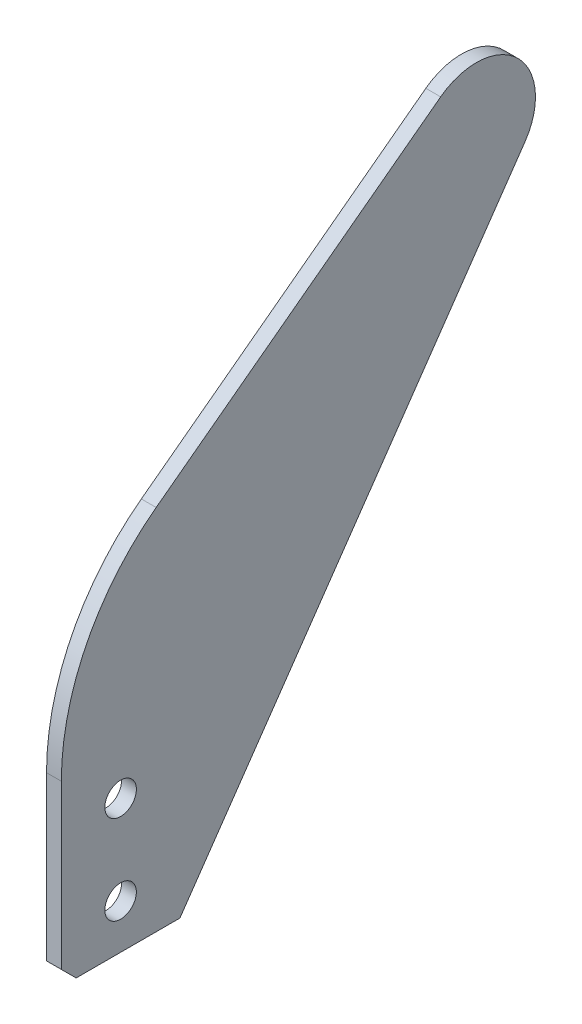
ISO-10303-21;
HEADER;
FILE_DESCRIPTION(('STEP AP214'),'2;1');
FILE_NAME('part.step','',(''),(''),'','','');
FILE_SCHEMA(('AUTOMOTIVE_DESIGN { 1 0 10303 214 1 1 1 1 }'));
ENDSEC;
DATA;
#1=APPLICATION_CONTEXT('core data for automotive mechanical design processes');
#2=APPLICATION_PROTOCOL_DEFINITION('international standard','automotive_design',2000,#1);
#3=PRODUCT_CONTEXT('',#1,'mechanical');
#4=PRODUCT('Part','Part','',(#3));
#5=PRODUCT_RELATED_PRODUCT_CATEGORY('part','',(#4));
#6=PRODUCT_DEFINITION_FORMATION('','',#4);
#7=PRODUCT_DEFINITION_CONTEXT('part definition',#1,'design');
#8=PRODUCT_DEFINITION('design','',#6,#7);
#9=PRODUCT_DEFINITION_SHAPE('','',#8);
#10=(LENGTH_UNIT() NAMED_UNIT(*) SI_UNIT(.MILLI.,.METRE.));
#11=(NAMED_UNIT(*) PLANE_ANGLE_UNIT() SI_UNIT($,.RADIAN.));
#12=(NAMED_UNIT(*) SI_UNIT($,.STERADIAN.) SOLID_ANGLE_UNIT());
#13=UNCERTAINTY_MEASURE_WITH_UNIT(LENGTH_MEASURE(1.E-05),#10,'distance_accuracy_value','');
#14=(GEOMETRIC_REPRESENTATION_CONTEXT(3) GLOBAL_UNCERTAINTY_ASSIGNED_CONTEXT((#13)) GLOBAL_UNIT_ASSIGNED_CONTEXT((#10,
#11,#12)) REPRESENTATION_CONTEXT('',''));
#15=CARTESIAN_POINT('',(0.,0.,0.));
#16=DIRECTION('',(0.,0.,1.));
#17=DIRECTION('',(1.,0.,0.));
#18=AXIS2_PLACEMENT_3D('',#15,#16,#17);
#19=CARTESIAN_POINT('',(3.175,114.3,-88.9));
#20=DIRECTION('',(-1.,0.,0.));
#21=DIRECTION('',(0.,0.,1.));
#22=AXIS2_PLACEMENT_3D('',#19,#20,#21);
#23=PLANE('',#22);
#24=DIRECTION('',(0.,-1.,0.));
#25=VECTOR('',#24,1.);
#26=CARTESIAN_POINT('',(3.175,0.,0.));
#27=LINE('',#26,#25);
#28=CARTESIAN_POINT('',(3.175,38.1,0.));
#29=VERTEX_POINT('',#28);
#30=CARTESIAN_POINT('',(3.175,3.17500000000001,0.));
#31=VERTEX_POINT('',#30);
#32=EDGE_CURVE('E140',#29,#31,#27,.T.);
#33=ORIENTED_EDGE('',*,*,#32,.T.);
#34=DIRECTION('',(0.,0.707106781186548,0.707106781186548));
#35=VECTOR('',#34,1.);
#36=CARTESIAN_POINT('',(3.175,0.,-3.17500000000001));
#37=LINE('',#36,#35);
#38=CARTESIAN_POINT('',(3.175,0.,-3.17500000000001));
#39=VERTEX_POINT('',#38);
#40=EDGE_CURVE('E11',#31,#39,#37,.F.);
#41=ORIENTED_EDGE('',*,*,#40,.T.);
#42=DIRECTION('',(0.,0.,-1.));
#43=VECTOR('',#42,1.);
#44=CARTESIAN_POINT('',(3.175,0.,0.));
#45=LINE('',#44,#43);
#46=CARTESIAN_POINT('',(3.175,0.,-25.4));
#47=VERTEX_POINT('',#46);
#48=EDGE_CURVE('E101',#39,#47,#45,.T.);
#49=ORIENTED_EDGE('',*,*,#48,.T.);
#50=DIRECTION('',(0.,0.822854310317324,-0.568252394620736));
#51=VECTOR('',#50,1.);
#52=CARTESIAN_POINT('',(3.175,0.,-25.4));
#53=LINE('',#52,#51);
#54=CARTESIAN_POINT('',(3.175,107.083194588317,-99.35024974103));
#55=VERTEX_POINT('',#54);
#56=EDGE_CURVE('E104',#47,#55,#53,.T.);
#57=ORIENTED_EDGE('',*,*,#56,.T.);
#58=CARTESIAN_POINT('',(3.175,114.3,-88.9));
#59=DIRECTION('',(1.,0.,0.));
#60=DIRECTION('',(0.,0.,1.));
#61=AXIS2_PLACEMENT_3D('',#58,#59,#60);
#62=CIRCLE('',#61,12.7);
#63=CARTESIAN_POINT('',(3.175,124.46,-81.28));
#64=VERTEX_POINT('',#63);
#65=EDGE_CURVE('E120',#55,#64,#62,.T.);
#66=ORIENTED_EDGE('',*,*,#65,.T.);
#67=DIRECTION('',(0.,-0.6,0.8));
#68=VECTOR('',#67,1.);
#69=CARTESIAN_POINT('',(3.175,124.46,-81.28));
#70=LINE('',#69,#68);
#71=CARTESIAN_POINT('',(3.175,78.74,-20.32));
#72=VERTEX_POINT('',#71);
#73=EDGE_CURVE('E155',#64,#72,#70,.T.);
#74=ORIENTED_EDGE('',*,*,#73,.T.);
#75=CARTESIAN_POINT('',(3.175,38.1,-50.8));
#76=DIRECTION('',(1.,0.,0.));
#77=DIRECTION('',(0.,0.,-1.));
#78=AXIS2_PLACEMENT_3D('',#75,#76,#77);
#79=CIRCLE('',#78,50.8);
#80=EDGE_CURVE('E153',#72,#29,#79,.T.);
#81=ORIENTED_EDGE('',*,*,#80,.T.);
#82=EDGE_LOOP('',(#33,#41,#49,#57,#66,#74,#81));
#83=FACE_BOUND('',#82,.T.);
#84=CARTESIAN_POINT('',(3.175,28.575,-12.7));
#85=DIRECTION('',(1.,0.,0.));
#86=DIRECTION('',(0.,0.,-1.));
#87=AXIS2_PLACEMENT_3D('',#84,#85,#86);
#88=CIRCLE('',#87,3.3782);
#89=CARTESIAN_POINT('',(3.175,28.575,-16.0782));
#90=VERTEX_POINT('',#89);
#91=EDGE_CURVE('E151',#90,#90,#88,.T.);
#92=ORIENTED_EDGE('',*,*,#91,.F.);
#93=EDGE_LOOP('',(#92));
#94=FACE_BOUND('',#93,.T.);
#95=CARTESIAN_POINT('',(3.175,9.525,-12.7));
#96=DIRECTION('',(1.,0.,0.));
#97=DIRECTION('',(0.,0.,-1.));
#98=AXIS2_PLACEMENT_3D('',#95,#96,#97);
#99=CIRCLE('',#98,3.3782);
#100=CARTESIAN_POINT('',(3.175,9.525,-16.0782));
#101=VERTEX_POINT('',#100);
#102=EDGE_CURVE('E161',#101,#101,#99,.T.);
#103=ORIENTED_EDGE('',*,*,#102,.F.);
#104=EDGE_LOOP('',(#103));
#105=FACE_BOUND('',#104,.T.);
#106=ADVANCED_FACE('F42',(#83,#94,#105),#23,.F.);
#107=CARTESIAN_POINT('',(0.,114.3,-88.9));
#108=DIRECTION('',(-1.,0.,0.));
#109=DIRECTION('',(0.,0.,1.));
#110=AXIS2_PLACEMENT_3D('',#107,#108,#109);
#111=PLANE('',#110);
#112=CARTESIAN_POINT('',(0.,28.575,-12.7));
#113=DIRECTION('',(1.,0.,0.));
#114=DIRECTION('',(0.,0.,-1.));
#115=AXIS2_PLACEMENT_3D('',#112,#113,#114);
#116=CIRCLE('',#115,3.3782);
#117=CARTESIAN_POINT('',(0.,28.575,-16.0782));
#118=VERTEX_POINT('',#117);
#119=EDGE_CURVE('E158',#118,#118,#116,.T.);
#120=ORIENTED_EDGE('',*,*,#119,.T.);
#121=EDGE_LOOP('',(#120));
#122=FACE_BOUND('',#121,.T.);
#123=DIRECTION('',(0.,0.,-1.));
#124=VECTOR('',#123,1.);
#125=CARTESIAN_POINT('',(0.,0.,0.));
#126=LINE('',#125,#124);
#127=CARTESIAN_POINT('',(0.,0.,-3.17500000000001));
#128=VERTEX_POINT('',#127);
#129=CARTESIAN_POINT('',(0.,0.,-25.4));
#130=VERTEX_POINT('',#129);
#131=EDGE_CURVE('E123',#128,#130,#126,.T.);
#132=ORIENTED_EDGE('',*,*,#131,.F.);
#133=DIRECTION('',(0.,-0.707106781186548,-0.707106781186548));
#134=VECTOR('',#133,1.);
#135=CARTESIAN_POINT('',(0.,14.2875,11.1125));
#136=LINE('',#135,#134);
#137=CARTESIAN_POINT('',(0.,3.17500000000001,0.));
#138=VERTEX_POINT('',#137);
#139=EDGE_CURVE('E65',#128,#138,#136,.F.);
#140=ORIENTED_EDGE('',*,*,#139,.T.);
#141=DIRECTION('',(0.,-1.,0.));
#142=VECTOR('',#141,1.);
#143=CARTESIAN_POINT('',(0.,0.,0.));
#144=LINE('',#143,#142);
#145=CARTESIAN_POINT('',(0.,38.1,0.));
#146=VERTEX_POINT('',#145);
#147=EDGE_CURVE('E111',#146,#138,#144,.T.);
#148=ORIENTED_EDGE('',*,*,#147,.F.);
#149=CARTESIAN_POINT('',(0.,38.1,-50.8));
#150=DIRECTION('',(1.,0.,0.));
#151=DIRECTION('',(0.,0.,-1.));
#152=AXIS2_PLACEMENT_3D('',#149,#150,#151);
#153=CIRCLE('',#152,50.8);
#154=CARTESIAN_POINT('',(0.,78.74,-20.32));
#155=VERTEX_POINT('',#154);
#156=EDGE_CURVE('E142',#155,#146,#153,.T.);
#157=ORIENTED_EDGE('',*,*,#156,.F.);
#158=DIRECTION('',(0.,-0.6,0.8));
#159=VECTOR('',#158,1.);
#160=CARTESIAN_POINT('',(0.,124.46,-81.28));
#161=LINE('',#160,#159);
#162=CARTESIAN_POINT('',(0.,124.46,-81.28));
#163=VERTEX_POINT('',#162);
#164=EDGE_CURVE('E144',#163,#155,#161,.T.);
#165=ORIENTED_EDGE('',*,*,#164,.F.);
#166=CARTESIAN_POINT('',(0.,114.3,-88.9));
#167=DIRECTION('',(1.,0.,0.));
#168=DIRECTION('',(0.,0.,1.));
#169=AXIS2_PLACEMENT_3D('',#166,#167,#168);
#170=CIRCLE('',#169,12.7);
#171=CARTESIAN_POINT('',(0.,107.083194588317,-99.35024974103));
#172=VERTEX_POINT('',#171);
#173=EDGE_CURVE('E146',#172,#163,#170,.T.);
#174=ORIENTED_EDGE('',*,*,#173,.F.);
#175=DIRECTION('',(0.,0.822854310317324,-0.568252394620736));
#176=VECTOR('',#175,1.);
#177=CARTESIAN_POINT('',(0.,0.,-25.4));
#178=LINE('',#177,#176);
#179=EDGE_CURVE('E148',#130,#172,#178,.T.);
#180=ORIENTED_EDGE('',*,*,#179,.F.);
#181=EDGE_LOOP('',(#132,#140,#148,#157,#165,#174,#180));
#182=FACE_BOUND('',#181,.T.);
#183=CARTESIAN_POINT('',(0.,9.525,-12.7));
#184=DIRECTION('',(1.,0.,0.));
#185=DIRECTION('',(0.,0.,-1.));
#186=AXIS2_PLACEMENT_3D('',#183,#184,#185);
#187=CIRCLE('',#186,3.3782);
#188=CARTESIAN_POINT('',(0.,9.525,-16.0782));
#189=VERTEX_POINT('',#188);
#190=EDGE_CURVE('E164',#189,#189,#187,.T.);
#191=ORIENTED_EDGE('',*,*,#190,.T.);
#192=EDGE_LOOP('',(#191));
#193=FACE_BOUND('',#192,.T.);
#194=ADVANCED_FACE('F174',(#122,#182,#193),#111,.T.);
#195=CARTESIAN_POINT('',(3.175,0.,0.));
#196=DIRECTION('',(0.,1.,0.));
#197=DIRECTION('',(0.,0.,1.));
#198=AXIS2_PLACEMENT_3D('',#195,#196,#197);
#199=PLANE('',#198);
#200=ORIENTED_EDGE('',*,*,#48,.F.);
#201=DIRECTION('',(-1.,0.,0.));
#202=VECTOR('',#201,1.);
#203=CARTESIAN_POINT('',(3.175,0.,-3.17500000000001));
#204=LINE('',#203,#202);
#205=EDGE_CURVE('E125',#39,#128,#204,.T.);
#206=ORIENTED_EDGE('',*,*,#205,.T.);
#207=ORIENTED_EDGE('',*,*,#131,.T.);
#208=DIRECTION('',(-1.,0.,0.));
#209=VECTOR('',#208,1.);
#210=CARTESIAN_POINT('',(3.175,0.,-25.4));
#211=LINE('',#210,#209);
#212=EDGE_CURVE('E116',#47,#130,#211,.T.);
#213=ORIENTED_EDGE('',*,*,#212,.F.);
#214=EDGE_LOOP('',(#200,#206,#207,#213));
#215=FACE_BOUND('',#214,.T.);
#216=ADVANCED_FACE('F122',(#215),#199,.F.);
#217=CARTESIAN_POINT('',(3.175,0.,-25.4));
#218=DIRECTION('',(0.,0.568252394620736,0.822854310317324));
#219=DIRECTION('',(0.,-0.822854310317324,0.568252394620736));
#220=AXIS2_PLACEMENT_3D('',#217,#218,#219);
#221=PLANE('',#220);
#222=ORIENTED_EDGE('',*,*,#179,.T.);
#223=DIRECTION('',(-1.,0.,0.));
#224=VECTOR('',#223,1.);
#225=CARTESIAN_POINT('',(3.175,107.083194588317,-99.35024974103));
#226=LINE('',#225,#224);
#227=EDGE_CURVE('E118',#55,#172,#226,.T.);
#228=ORIENTED_EDGE('',*,*,#227,.F.);
#229=ORIENTED_EDGE('',*,*,#56,.F.);
#230=ORIENTED_EDGE('',*,*,#212,.T.);
#231=EDGE_LOOP('',(#222,#228,#229,#230));
#232=FACE_BOUND('',#231,.T.);
#233=ADVANCED_FACE('F115',(#232),#221,.F.);
#234=CARTESIAN_POINT('',(3.175,114.3,-88.9));
#235=DIRECTION('',(-1.,0.,0.));
#236=DIRECTION('',(0.,0.,1.));
#237=AXIS2_PLACEMENT_3D('',#234,#235,#236);
#238=CYLINDRICAL_SURFACE('',#237,12.7);
#239=ORIENTED_EDGE('',*,*,#173,.T.);
#240=DIRECTION('',(-1.,0.,0.));
#241=VECTOR('',#240,1.);
#242=CARTESIAN_POINT('',(3.175,124.46,-81.28));
#243=LINE('',#242,#241);
#244=EDGE_CURVE('E128',#64,#163,#243,.T.);
#245=ORIENTED_EDGE('',*,*,#244,.F.);
#246=ORIENTED_EDGE('',*,*,#65,.F.);
#247=ORIENTED_EDGE('',*,*,#227,.T.);
#248=EDGE_LOOP('',(#239,#245,#246,#247));
#249=FACE_BOUND('',#248,.T.);
#250=ADVANCED_FACE('F195',(#249),#238,.T.);
#251=CARTESIAN_POINT('',(3.175,124.46,-81.28));
#252=DIRECTION('',(0.,-0.8,-0.6));
#253=DIRECTION('',(0.,0.6,-0.8));
#254=AXIS2_PLACEMENT_3D('',#251,#252,#253);
#255=PLANE('',#254);
#256=ORIENTED_EDGE('',*,*,#164,.T.);
#257=DIRECTION('',(-1.,0.,0.));
#258=VECTOR('',#257,1.);
#259=CARTESIAN_POINT('',(3.175,78.74,-20.32));
#260=LINE('',#259,#258);
#261=EDGE_CURVE('E134',#72,#155,#260,.T.);
#262=ORIENTED_EDGE('',*,*,#261,.F.);
#263=ORIENTED_EDGE('',*,*,#73,.F.);
#264=ORIENTED_EDGE('',*,*,#244,.T.);
#265=EDGE_LOOP('',(#256,#262,#263,#264));
#266=FACE_BOUND('',#265,.T.);
#267=ADVANCED_FACE('F191',(#266),#255,.F.);
#268=CARTESIAN_POINT('',(3.175,38.1,-50.8));
#269=DIRECTION('',(-1.,0.,0.));
#270=DIRECTION('',(0.,0.,1.));
#271=AXIS2_PLACEMENT_3D('',#268,#269,#270);
#272=CYLINDRICAL_SURFACE('',#271,50.8);
#273=ORIENTED_EDGE('',*,*,#156,.T.);
#274=DIRECTION('',(-1.,0.,0.));
#275=VECTOR('',#274,1.);
#276=CARTESIAN_POINT('',(3.175,38.1,0.));
#277=LINE('',#276,#275);
#278=EDGE_CURVE('E137',#29,#146,#277,.T.);
#279=ORIENTED_EDGE('',*,*,#278,.F.);
#280=ORIENTED_EDGE('',*,*,#80,.F.);
#281=ORIENTED_EDGE('',*,*,#261,.T.);
#282=EDGE_LOOP('',(#273,#279,#280,#281));
#283=FACE_BOUND('',#282,.T.);
#284=ADVANCED_FACE('F188',(#283),#272,.T.);
#285=CARTESIAN_POINT('',(3.175,0.,0.));
#286=DIRECTION('',(0.,0.,-1.));
#287=DIRECTION('',(-1.,0.,0.));
#288=AXIS2_PLACEMENT_3D('',#285,#286,#287);
#289=PLANE('',#288);
#290=ORIENTED_EDGE('',*,*,#147,.T.);
#291=DIRECTION('',(1.,0.,0.));
#292=VECTOR('',#291,1.);
#293=CARTESIAN_POINT('',(3.175,3.17500000000001,0.));
#294=LINE('',#293,#292);
#295=EDGE_CURVE('E51',#138,#31,#294,.T.);
#296=ORIENTED_EDGE('',*,*,#295,.T.);
#297=ORIENTED_EDGE('',*,*,#32,.F.);
#298=ORIENTED_EDGE('',*,*,#278,.T.);
#299=EDGE_LOOP('',(#290,#296,#297,#298));
#300=FACE_BOUND('',#299,.T.);
#301=ADVANCED_FACE('F185',(#300),#289,.F.);
#302=CARTESIAN_POINT('',(3.175,28.575,-12.7));
#303=DIRECTION('',(-1.,0.,0.));
#304=DIRECTION('',(0.,0.,1.));
#305=AXIS2_PLACEMENT_3D('',#302,#303,#304);
#306=CYLINDRICAL_SURFACE('',#305,3.3782);
#307=ORIENTED_EDGE('',*,*,#91,.T.);
#308=EDGE_LOOP('',(#307));
#309=FACE_BOUND('',#308,.T.);
#310=ORIENTED_EDGE('',*,*,#119,.F.);
#311=EDGE_LOOP('',(#310));
#312=FACE_BOUND('',#311,.T.);
#313=ADVANCED_FACE('F182',(#309,#312),#306,.F.);
#314=CARTESIAN_POINT('',(3.175,9.525,-12.7));
#315=DIRECTION('',(-1.,0.,0.));
#316=DIRECTION('',(0.,0.,1.));
#317=AXIS2_PLACEMENT_3D('',#314,#315,#316);
#318=CYLINDRICAL_SURFACE('',#317,3.3782);
#319=ORIENTED_EDGE('',*,*,#102,.T.);
#320=EDGE_LOOP('',(#319));
#321=FACE_BOUND('',#320,.T.);
#322=ORIENTED_EDGE('',*,*,#190,.F.);
#323=EDGE_LOOP('',(#322));
#324=FACE_BOUND('',#323,.T.);
#325=ADVANCED_FACE('F170',(#321,#324),#318,.F.);
#326=CARTESIAN_POINT('',(3.175,0.,-3.17500000000001));
#327=DIRECTION('',(0.,0.707106781186548,-0.707106781186548));
#328=DIRECTION('',(-1.,0.,0.));
#329=AXIS2_PLACEMENT_3D('',#326,#327,#328);
#330=PLANE('',#329);
#331=ORIENTED_EDGE('',*,*,#40,.F.);
#332=ORIENTED_EDGE('',*,*,#295,.F.);
#333=ORIENTED_EDGE('',*,*,#139,.F.);
#334=ORIENTED_EDGE('',*,*,#205,.F.);
#335=EDGE_LOOP('',(#331,#332,#333,#334));
#336=FACE_BOUND('',#335,.T.);
#337=ADVANCED_FACE('F45',(#336),#330,.F.);
#338=CLOSED_SHELL('',(#106,#194,#216,#233,#250,#267,#284,#301,#313,#325,#337));
#339=MANIFOLD_SOLID_BREP('B2',#338);
#340=ADVANCED_BREP_SHAPE_REPRESENTATION('',(#18,#339),#14);
#341=SHAPE_DEFINITION_REPRESENTATION(#9,#340);
ENDSEC;
END-ISO-10303-21;
